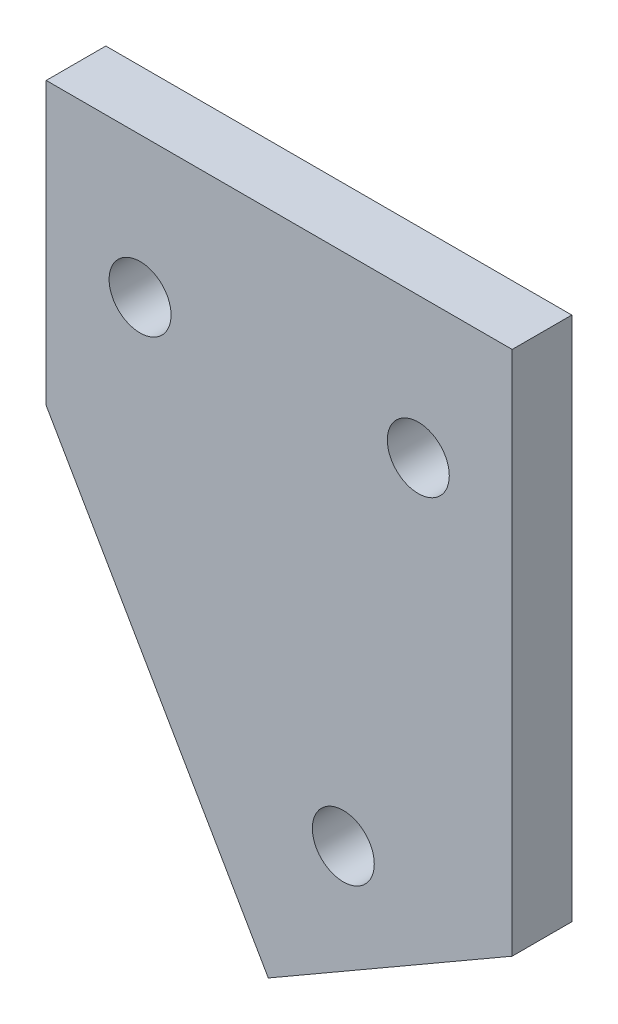
ISO-10303-21;
HEADER;
FILE_DESCRIPTION(('STEP AP214'),'2;1');
FILE_NAME('part.step','',(''),(''),'','','');
FILE_SCHEMA(('AUTOMOTIVE_DESIGN { 1 0 10303 214 1 1 1 1 }'));
ENDSEC;
DATA;
#1=APPLICATION_CONTEXT('core data for automotive mechanical design processes');
#2=APPLICATION_PROTOCOL_DEFINITION('international standard','automotive_design',2000,#1);
#3=PRODUCT_CONTEXT('',#1,'mechanical');
#4=PRODUCT('Part','Part','',(#3));
#5=PRODUCT_RELATED_PRODUCT_CATEGORY('part','',(#4));
#6=PRODUCT_DEFINITION_FORMATION('','',#4);
#7=PRODUCT_DEFINITION_CONTEXT('part definition',#1,'design');
#8=PRODUCT_DEFINITION('design','',#6,#7);
#9=PRODUCT_DEFINITION_SHAPE('','',#8);
#10=(LENGTH_UNIT() NAMED_UNIT(*) SI_UNIT(.MILLI.,.METRE.));
#11=(NAMED_UNIT(*) PLANE_ANGLE_UNIT() SI_UNIT($,.RADIAN.));
#12=(NAMED_UNIT(*) SI_UNIT($,.STERADIAN.) SOLID_ANGLE_UNIT());
#13=UNCERTAINTY_MEASURE_WITH_UNIT(LENGTH_MEASURE(1.E-05),#10,'distance_accuracy_value','');
#14=(GEOMETRIC_REPRESENTATION_CONTEXT(3) GLOBAL_UNCERTAINTY_ASSIGNED_CONTEXT((#13)) GLOBAL_UNIT_ASSIGNED_CONTEXT((#10,
#11,#12)) REPRESENTATION_CONTEXT('',''));
#15=CARTESIAN_POINT('',(0.,0.,0.));
#16=DIRECTION('',(0.,0.,1.));
#17=DIRECTION('',(1.,0.,0.));
#18=AXIS2_PLACEMENT_3D('',#15,#16,#17);
#19=CARTESIAN_POINT('',(0.,0.,3.175));
#20=DIRECTION('',(0.,0.,-1.));
#21=DIRECTION('',(-1.,0.,0.));
#22=AXIS2_PLACEMENT_3D('',#19,#20,#21);
#23=PLANE('',#22);
#24=DIRECTION('',(0.,-1.,0.));
#25=VECTOR('',#24,1.);
#26=CARTESIAN_POINT('',(0.,15.,3.175));
#27=LINE('',#26,#25);
#28=CARTESIAN_POINT('',(0.,15.,3.175));
#29=VERTEX_POINT('',#28);
#30=CARTESIAN_POINT('',(0.,0.,3.175));
#31=VERTEX_POINT('',#30);
#32=EDGE_CURVE('E139',#29,#31,#27,.T.);
#33=ORIENTED_EDGE('',*,*,#32,.T.);
#34=DIRECTION('',(0.499999999999995,-0.866025403784442,0.));
#35=VECTOR('',#34,1.);
#36=CARTESIAN_POINT('',(0.,0.,3.175));
#37=LINE('',#36,#35);
#38=CARTESIAN_POINT('',(11.830127018922,-20.4903810567665,3.175));
#39=VERTEX_POINT('',#38);
#40=EDGE_CURVE('E97',#31,#39,#37,.T.);
#41=ORIENTED_EDGE('',*,*,#40,.T.);
#42=DIRECTION('',(0.866025403784445,0.499999999999988,0.));
#43=VECTOR('',#42,1.);
#44=CARTESIAN_POINT('',(11.830127018922,-20.4903810567665,3.175));
#45=LINE('',#44,#43);
#46=CARTESIAN_POINT('',(24.8205080756886,-12.9903810567666,3.175));
#47=VERTEX_POINT('',#46);
#48=EDGE_CURVE('E101',#39,#47,#45,.T.);
#49=ORIENTED_EDGE('',*,*,#48,.T.);
#50=DIRECTION('',(0.,1.,0.));
#51=VECTOR('',#50,1.);
#52=CARTESIAN_POINT('',(24.8205080756886,-12.9903810567666,3.175));
#53=LINE('',#52,#51);
#54=CARTESIAN_POINT('',(24.8205080756886,15.,3.175));
#55=VERTEX_POINT('',#54);
#56=EDGE_CURVE('E105',#47,#55,#53,.T.);
#57=ORIENTED_EDGE('',*,*,#56,.T.);
#58=DIRECTION('',(-1.,0.,0.));
#59=VECTOR('',#58,1.);
#60=CARTESIAN_POINT('',(24.8205080756886,15.,3.175));
#61=LINE('',#60,#59);
#62=EDGE_CURVE('E63',#55,#29,#61,.T.);
#63=ORIENTED_EDGE('',*,*,#62,.T.);
#64=EDGE_LOOP('',(#33,#41,#49,#57,#63));
#65=FACE_BOUND('',#64,.T.);
#66=CARTESIAN_POINT('',(15.8253175473053,-12.4102540378443,3.175));
#67=DIRECTION('',(0.,0.,1.));
#68=DIRECTION('',(1.,0.,0.));
#69=AXIS2_PLACEMENT_3D('',#66,#67,#68);
#70=CIRCLE('',#69,1.64999999999999);
#71=CARTESIAN_POINT('',(17.4753175473053,-12.4102540378443,3.175));
#72=VERTEX_POINT('',#71);
#73=EDGE_CURVE('E130',#72,#72,#70,.T.);
#74=ORIENTED_EDGE('',*,*,#73,.F.);
#75=EDGE_LOOP('',(#74));
#76=FACE_BOUND('',#75,.T.);
#77=CARTESIAN_POINT('',(5.,7.5,3.175));
#78=DIRECTION('',(0.,0.,1.));
#79=DIRECTION('',(1.,0.,0.));
#80=AXIS2_PLACEMENT_3D('',#77,#78,#79);
#81=CIRCLE('',#80,1.65);
#82=CARTESIAN_POINT('',(6.65,7.5,3.175));
#83=VERTEX_POINT('',#82);
#84=EDGE_CURVE('E193',#83,#83,#81,.T.);
#85=ORIENTED_EDGE('',*,*,#84,.F.);
#86=EDGE_LOOP('',(#85));
#87=FACE_BOUND('',#86,.T.);
#88=CARTESIAN_POINT('',(19.8205080756886,7.5,3.175));
#89=DIRECTION('',(0.,0.,1.));
#90=DIRECTION('',(1.,0.,0.));
#91=AXIS2_PLACEMENT_3D('',#88,#89,#90);
#92=CIRCLE('',#91,1.65);
#93=CARTESIAN_POINT('',(21.4705080756886,7.5,3.175));
#94=VERTEX_POINT('',#93);
#95=EDGE_CURVE('E182',#94,#94,#92,.T.);
#96=ORIENTED_EDGE('',*,*,#95,.F.);
#97=EDGE_LOOP('',(#96));
#98=FACE_BOUND('',#97,.T.);
#99=ADVANCED_FACE('F45',(#65,#76,#87,#98),#23,.F.);
#100=CARTESIAN_POINT('',(0.,0.,0.));
#101=DIRECTION('',(0.,0.,-1.));
#102=DIRECTION('',(-1.,0.,0.));
#103=AXIS2_PLACEMENT_3D('',#100,#101,#102);
#104=PLANE('',#103);
#105=CARTESIAN_POINT('',(5.,7.5,0.));
#106=DIRECTION('',(0.,0.,1.));
#107=DIRECTION('',(1.,0.,0.));
#108=AXIS2_PLACEMENT_3D('',#105,#106,#107);
#109=CIRCLE('',#108,1.65);
#110=CARTESIAN_POINT('',(6.65,7.5,0.));
#111=VERTEX_POINT('',#110);
#112=EDGE_CURVE('E190',#111,#111,#109,.T.);
#113=ORIENTED_EDGE('',*,*,#112,.T.);
#114=EDGE_LOOP('',(#113));
#115=FACE_BOUND('',#114,.T.);
#116=DIRECTION('',(0.,-1.,0.));
#117=VECTOR('',#116,1.);
#118=CARTESIAN_POINT('',(0.,15.,0.));
#119=LINE('',#118,#117);
#120=CARTESIAN_POINT('',(0.,15.,0.));
#121=VERTEX_POINT('',#120);
#122=CARTESIAN_POINT('',(0.,0.,0.));
#123=VERTEX_POINT('',#122);
#124=EDGE_CURVE('E125',#121,#123,#119,.T.);
#125=ORIENTED_EDGE('',*,*,#124,.F.);
#126=DIRECTION('',(-1.,0.,0.));
#127=VECTOR('',#126,1.);
#128=CARTESIAN_POINT('',(24.8205080756886,15.,0.));
#129=LINE('',#128,#127);
#130=CARTESIAN_POINT('',(24.8205080756886,15.,0.));
#131=VERTEX_POINT('',#130);
#132=EDGE_CURVE('E89',#131,#121,#129,.T.);
#133=ORIENTED_EDGE('',*,*,#132,.F.);
#134=DIRECTION('',(0.,1.,0.));
#135=VECTOR('',#134,1.);
#136=CARTESIAN_POINT('',(24.8205080756886,-12.9903810567666,0.));
#137=LINE('',#136,#135);
#138=CARTESIAN_POINT('',(24.8205080756886,-12.9903810567666,0.));
#139=VERTEX_POINT('',#138);
#140=EDGE_CURVE('E83',#139,#131,#137,.T.);
#141=ORIENTED_EDGE('',*,*,#140,.F.);
#142=DIRECTION('',(0.866025403784445,0.499999999999988,0.));
#143=VECTOR('',#142,1.);
#144=CARTESIAN_POINT('',(11.830127018922,-20.4903810567665,0.));
#145=LINE('',#144,#143);
#146=CARTESIAN_POINT('',(11.830127018922,-20.4903810567665,0.));
#147=VERTEX_POINT('',#146);
#148=EDGE_CURVE('E113',#147,#139,#145,.T.);
#149=ORIENTED_EDGE('',*,*,#148,.F.);
#150=DIRECTION('',(0.499999999999995,-0.866025403784442,0.));
#151=VECTOR('',#150,1.);
#152=CARTESIAN_POINT('',(0.,0.,0.));
#153=LINE('',#152,#151);
#154=EDGE_CURVE('E129',#123,#147,#153,.T.);
#155=ORIENTED_EDGE('',*,*,#154,.F.);
#156=EDGE_LOOP('',(#125,#133,#141,#149,#155));
#157=FACE_BOUND('',#156,.T.);
#158=CARTESIAN_POINT('',(15.8253175473053,-12.4102540378443,0.));
#159=DIRECTION('',(0.,0.,1.));
#160=DIRECTION('',(1.,0.,0.));
#161=AXIS2_PLACEMENT_3D('',#158,#159,#160);
#162=CIRCLE('',#161,1.64999999999999);
#163=CARTESIAN_POINT('',(17.4753175473053,-12.4102540378443,0.));
#164=VERTEX_POINT('',#163);
#165=EDGE_CURVE('E197',#164,#164,#162,.T.);
#166=ORIENTED_EDGE('',*,*,#165,.T.);
#167=EDGE_LOOP('',(#166));
#168=FACE_BOUND('',#167,.T.);
#169=CARTESIAN_POINT('',(19.8205080756886,7.5,0.));
#170=DIRECTION('',(0.,0.,1.));
#171=DIRECTION('',(1.,0.,0.));
#172=AXIS2_PLACEMENT_3D('',#169,#170,#171);
#173=CIRCLE('',#172,1.65);
#174=CARTESIAN_POINT('',(21.4705080756886,7.5,0.));
#175=VERTEX_POINT('',#174);
#176=EDGE_CURVE('E185',#175,#175,#173,.T.);
#177=ORIENTED_EDGE('',*,*,#176,.T.);
#178=EDGE_LOOP('',(#177));
#179=FACE_BOUND('',#178,.T.);
#180=ADVANCED_FACE('F146',(#115,#157,#168,#179),#104,.T.);
#181=CARTESIAN_POINT('',(0.,15.,3.175));
#182=DIRECTION('',(1.,0.,0.));
#183=DIRECTION('',(0.,1.,0.));
#184=AXIS2_PLACEMENT_3D('',#181,#182,#183);
#185=PLANE('',#184);
#186=ORIENTED_EDGE('',*,*,#124,.T.);
#187=DIRECTION('',(0.,0.,-1.));
#188=VECTOR('',#187,1.);
#189=CARTESIAN_POINT('',(0.,0.,3.175));
#190=LINE('',#189,#188);
#191=EDGE_CURVE('E11',#31,#123,#190,.T.);
#192=ORIENTED_EDGE('',*,*,#191,.F.);
#193=ORIENTED_EDGE('',*,*,#32,.F.);
#194=DIRECTION('',(0.,0.,-1.));
#195=VECTOR('',#194,1.);
#196=CARTESIAN_POINT('',(0.,15.,3.175));
#197=LINE('',#196,#195);
#198=EDGE_CURVE('E121',#29,#121,#197,.T.);
#199=ORIENTED_EDGE('',*,*,#198,.T.);
#200=EDGE_LOOP('',(#186,#192,#193,#199));
#201=FACE_BOUND('',#200,.T.);
#202=ADVANCED_FACE('F47',(#201),#185,.F.);
#203=CARTESIAN_POINT('',(0.,0.,3.175));
#204=DIRECTION('',(0.866025403784442,0.499999999999995,0.));
#205=DIRECTION('',(-0.499999999999995,0.866025403784442,0.));
#206=AXIS2_PLACEMENT_3D('',#203,#204,#205);
#207=PLANE('',#206);
#208=ORIENTED_EDGE('',*,*,#154,.T.);
#209=DIRECTION('',(0.,0.,-1.));
#210=VECTOR('',#209,1.);
#211=CARTESIAN_POINT('',(11.830127018922,-20.4903810567665,3.175));
#212=LINE('',#211,#210);
#213=EDGE_CURVE('E55',#39,#147,#212,.T.);
#214=ORIENTED_EDGE('',*,*,#213,.F.);
#215=ORIENTED_EDGE('',*,*,#40,.F.);
#216=ORIENTED_EDGE('',*,*,#191,.T.);
#217=EDGE_LOOP('',(#208,#214,#215,#216));
#218=FACE_BOUND('',#217,.T.);
#219=ADVANCED_FACE('F247',(#218),#207,.F.);
#220=CARTESIAN_POINT('',(11.830127018922,-20.4903810567665,3.175));
#221=DIRECTION('',(-0.499999999999988,0.866025403784446,0.));
#222=DIRECTION('',(-0.866025403784446,-0.499999999999988,0.));
#223=AXIS2_PLACEMENT_3D('',#220,#221,#222);
#224=PLANE('',#223);
#225=ORIENTED_EDGE('',*,*,#148,.T.);
#226=DIRECTION('',(0.,0.,-1.));
#227=VECTOR('',#226,1.);
#228=CARTESIAN_POINT('',(24.8205080756886,-12.9903810567666,3.175));
#229=LINE('',#228,#227);
#230=EDGE_CURVE('E110',#47,#139,#229,.T.);
#231=ORIENTED_EDGE('',*,*,#230,.F.);
#232=ORIENTED_EDGE('',*,*,#48,.F.);
#233=ORIENTED_EDGE('',*,*,#213,.T.);
#234=EDGE_LOOP('',(#225,#231,#232,#233));
#235=FACE_BOUND('',#234,.T.);
#236=ADVANCED_FACE('F111',(#235),#224,.F.);
#237=CARTESIAN_POINT('',(24.8205080756886,-12.9903810567666,3.175));
#238=DIRECTION('',(-1.,0.,0.));
#239=DIRECTION('',(0.,0.,1.));
#240=AXIS2_PLACEMENT_3D('',#237,#238,#239);
#241=PLANE('',#240);
#242=ORIENTED_EDGE('',*,*,#140,.T.);
#243=DIRECTION('',(0.,0.,-1.));
#244=VECTOR('',#243,1.);
#245=CARTESIAN_POINT('',(24.8205080756886,15.,3.175));
#246=LINE('',#245,#244);
#247=EDGE_CURVE('E115',#55,#131,#246,.T.);
#248=ORIENTED_EDGE('',*,*,#247,.F.);
#249=ORIENTED_EDGE('',*,*,#56,.F.);
#250=ORIENTED_EDGE('',*,*,#230,.T.);
#251=EDGE_LOOP('',(#242,#248,#249,#250));
#252=FACE_BOUND('',#251,.T.);
#253=ADVANCED_FACE('F117',(#252),#241,.F.);
#254=CARTESIAN_POINT('',(24.8205080756886,15.,3.175));
#255=DIRECTION('',(0.,-1.,0.));
#256=DIRECTION('',(1.,0.,0.));
#257=AXIS2_PLACEMENT_3D('',#254,#255,#256);
#258=PLANE('',#257);
#259=ORIENTED_EDGE('',*,*,#132,.T.);
#260=ORIENTED_EDGE('',*,*,#198,.F.);
#261=ORIENTED_EDGE('',*,*,#62,.F.);
#262=ORIENTED_EDGE('',*,*,#247,.T.);
#263=EDGE_LOOP('',(#259,#260,#261,#262));
#264=FACE_BOUND('',#263,.T.);
#265=ADVANCED_FACE('F151',(#264),#258,.F.);
#266=CARTESIAN_POINT('',(15.8253175473053,-12.4102540378443,3.175));
#267=DIRECTION('',(0.,0.,-1.));
#268=DIRECTION('',(-1.,0.,0.));
#269=AXIS2_PLACEMENT_3D('',#266,#267,#268);
#270=CYLINDRICAL_SURFACE('',#269,1.64999999999999);
#271=ORIENTED_EDGE('',*,*,#73,.T.);
#272=EDGE_LOOP('',(#271));
#273=FACE_BOUND('',#272,.T.);
#274=ORIENTED_EDGE('',*,*,#165,.F.);
#275=EDGE_LOOP('',(#274));
#276=FACE_BOUND('',#275,.T.);
#277=ADVANCED_FACE('F153',(#273,#276),#270,.F.);
#278=CARTESIAN_POINT('',(5.,7.5,3.175));
#279=DIRECTION('',(0.,0.,-1.));
#280=DIRECTION('',(-1.,0.,0.));
#281=AXIS2_PLACEMENT_3D('',#278,#279,#280);
#282=CYLINDRICAL_SURFACE('',#281,1.65);
#283=ORIENTED_EDGE('',*,*,#84,.T.);
#284=EDGE_LOOP('',(#283));
#285=FACE_BOUND('',#284,.T.);
#286=ORIENTED_EDGE('',*,*,#112,.F.);
#287=EDGE_LOOP('',(#286));
#288=FACE_BOUND('',#287,.T.);
#289=ADVANCED_FACE('F159',(#285,#288),#282,.F.);
#290=CARTESIAN_POINT('',(19.8205080756886,7.5,3.175));
#291=DIRECTION('',(0.,0.,-1.));
#292=DIRECTION('',(-1.,0.,0.));
#293=AXIS2_PLACEMENT_3D('',#290,#291,#292);
#294=CYLINDRICAL_SURFACE('',#293,1.65);
#295=ORIENTED_EDGE('',*,*,#95,.T.);
#296=EDGE_LOOP('',(#295));
#297=FACE_BOUND('',#296,.T.);
#298=ORIENTED_EDGE('',*,*,#176,.F.);
#299=EDGE_LOOP('',(#298));
#300=FACE_BOUND('',#299,.T.);
#301=ADVANCED_FACE('F173',(#297,#300),#294,.F.);
#302=CLOSED_SHELL('',(#99,#180,#202,#219,#236,#253,#265,#277,#289,#301));
#303=MANIFOLD_SOLID_BREP('B2',#302);
#304=ADVANCED_BREP_SHAPE_REPRESENTATION('',(#18,#303),#14);
#305=SHAPE_DEFINITION_REPRESENTATION(#9,#304);
ENDSEC;
END-ISO-10303-21;
